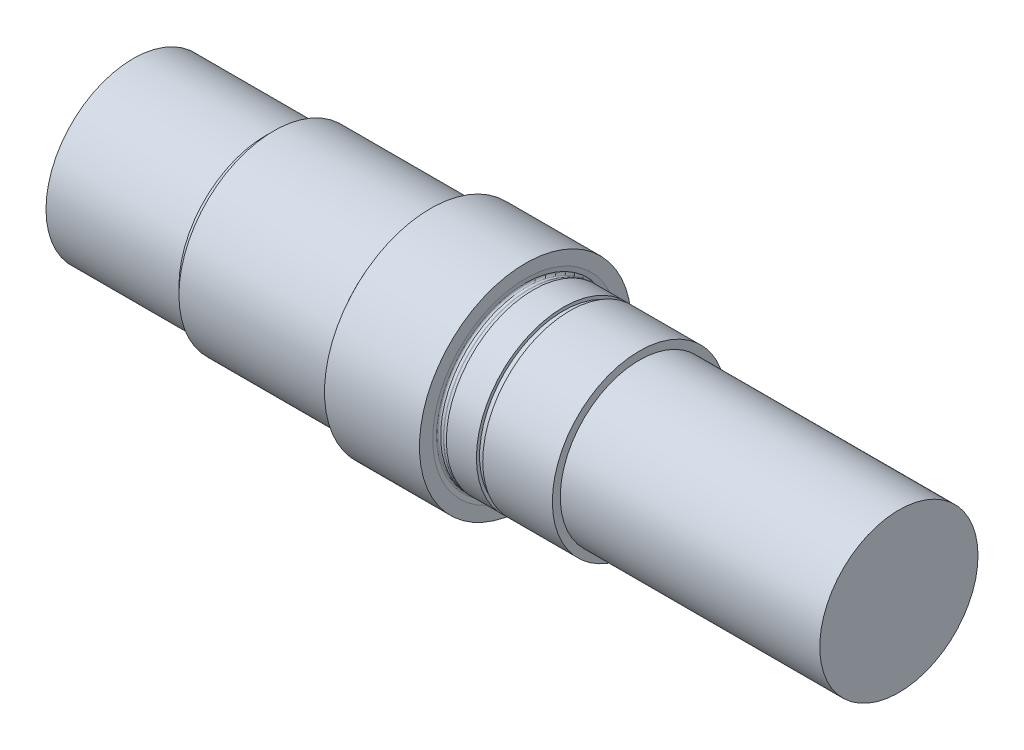
ISO-10303-21;
HEADER;
FILE_DESCRIPTION(('STEP AP214'),'2;1');
FILE_NAME('part.step','',(''),(''),'','','');
FILE_SCHEMA(('AUTOMOTIVE_DESIGN { 1 0 10303 214 1 1 1 1 }'));
ENDSEC;
DATA;
#1=APPLICATION_CONTEXT('core data for automotive mechanical design processes');
#2=APPLICATION_PROTOCOL_DEFINITION('international standard','automotive_design',2000,#1);
#3=PRODUCT_CONTEXT('',#1,'mechanical');
#4=PRODUCT('Part','Part','',(#3));
#5=PRODUCT_RELATED_PRODUCT_CATEGORY('part','',(#4));
#6=PRODUCT_DEFINITION_FORMATION('','',#4);
#7=PRODUCT_DEFINITION_CONTEXT('part definition',#1,'design');
#8=PRODUCT_DEFINITION('design','',#6,#7);
#9=PRODUCT_DEFINITION_SHAPE('','',#8);
#10=(LENGTH_UNIT() NAMED_UNIT(*) SI_UNIT(.MILLI.,.METRE.));
#11=(NAMED_UNIT(*) PLANE_ANGLE_UNIT() SI_UNIT($,.RADIAN.));
#12=(NAMED_UNIT(*) SI_UNIT($,.STERADIAN.) SOLID_ANGLE_UNIT());
#13=UNCERTAINTY_MEASURE_WITH_UNIT(LENGTH_MEASURE(1.E-05),#10,'distance_accuracy_value','');
#14=(GEOMETRIC_REPRESENTATION_CONTEXT(3) GLOBAL_UNCERTAINTY_ASSIGNED_CONTEXT((#13)) GLOBAL_UNIT_ASSIGNED_CONTEXT((#10,
#11,#12)) REPRESENTATION_CONTEXT('',''));
#15=CARTESIAN_POINT('',(0.,0.,0.));
#16=DIRECTION('',(0.,0.,1.));
#17=DIRECTION('',(1.,0.,0.));
#18=AXIS2_PLACEMENT_3D('',#15,#16,#17);
#19=CARTESIAN_POINT('',(0.,0.,0.));
#20=DIRECTION('',(-1.,0.,0.));
#21=DIRECTION('',(0.,0.,1.));
#22=AXIS2_PLACEMENT_3D('',#19,#20,#21);
#23=PLANE('',#22);
#24=CARTESIAN_POINT('',(0.,0.,0.));
#25=DIRECTION('',(1.,0.,0.));
#26=DIRECTION('',(0.,0.,-1.));
#27=AXIS2_PLACEMENT_3D('',#24,#25,#26);
#28=CIRCLE('',#27,27.5);
#29=CARTESIAN_POINT('',(0.,0.,-27.5));
#30=VERTEX_POINT('',#29);
#31=EDGE_CURVE('E10',#30,#30,#28,.T.);
#32=ORIENTED_EDGE('',*,*,#31,.F.);
#33=EDGE_LOOP('',(#32));
#34=FACE_BOUND('',#33,.T.);
#35=ADVANCED_FACE('F31',(#34),#23,.T.);
#36=CARTESIAN_POINT('',(242.,0.,0.));
#37=DIRECTION('',(1.,0.,0.));
#38=DIRECTION('',(0.,0.,-1.));
#39=AXIS2_PLACEMENT_3D('',#36,#37,#38);
#40=CYLINDRICAL_SURFACE('',#39,27.5);
#41=ORIENTED_EDGE('',*,*,#31,.T.);
#42=EDGE_LOOP('',(#41));
#43=FACE_BOUND('',#42,.T.);
#44=CARTESIAN_POINT('',(42.,0.,0.));
#45=DIRECTION('',(1.,0.,0.));
#46=DIRECTION('',(0.,0.,-1.));
#47=AXIS2_PLACEMENT_3D('',#44,#45,#46);
#48=CIRCLE('',#47,27.5);
#49=CARTESIAN_POINT('',(42.,0.,-27.5));
#50=VERTEX_POINT('',#49);
#51=EDGE_CURVE('E37',#50,#50,#48,.T.);
#52=ORIENTED_EDGE('',*,*,#51,.F.);
#53=EDGE_LOOP('',(#52));
#54=FACE_BOUND('',#53,.T.);
#55=ADVANCED_FACE('F142',(#43,#54),#40,.T.);
#56=CARTESIAN_POINT('',(43.0433153137616,0.,0.));
#57=DIRECTION('',(-1.,0.,0.));
#58=DIRECTION('',(0.,0.,1.));
#59=AXIS2_PLACEMENT_3D('',#56,#57,#58);
#60=CONICAL_SURFACE('',#59,27.2204445042266,0.261799387799148);
#61=ORIENTED_EDGE('',*,*,#51,.T.);
#62=EDGE_LOOP('',(#61));
#63=FACE_BOUND('',#62,.T.);
#64=CARTESIAN_POINT('',(43.0433153137616,0.,0.));
#65=DIRECTION('',(1.,0.,0.));
#66=DIRECTION('',(0.,0.,-1.));
#67=AXIS2_PLACEMENT_3D('',#64,#65,#66);
#68=CIRCLE('',#67,27.2204445042266);
#69=CARTESIAN_POINT('',(43.0433153137616,0.,-27.2204445042266));
#70=VERTEX_POINT('',#69);
#71=EDGE_CURVE('E41',#70,#70,#68,.T.);
#72=ORIENTED_EDGE('',*,*,#71,.F.);
#73=EDGE_LOOP('',(#72));
#74=FACE_BOUND('',#73,.T.);
#75=ADVANCED_FACE('F147',(#63,#74),#60,.T.);
#76=CARTESIAN_POINT('',(43.1986067408231,0.,0.));
#77=DIRECTION('',(1.,0.,0.));
#78=DIRECTION('',(0.,0.,-1.));
#79=AXIS2_PLACEMENT_3D('',#76,#77,#78);
#80=TOROIDAL_SURFACE('',#79,27.8,0.6);
#81=ORIENTED_EDGE('',*,*,#71,.T.);
#82=EDGE_LOOP('',(#81));
#83=FACE_BOUND('',#82,.T.);
#84=CARTESIAN_POINT('',(43.1986067408231,0.,0.));
#85=DIRECTION('',(1.,0.,0.));
#86=DIRECTION('',(0.,0.,-1.));
#87=AXIS2_PLACEMENT_3D('',#84,#85,#86);
#88=CIRCLE('',#87,27.2);
#89=CARTESIAN_POINT('',(43.1986067408231,0.,-27.2));
#90=VERTEX_POINT('',#89);
#91=EDGE_CURVE('E45',#90,#90,#88,.T.);
#92=ORIENTED_EDGE('',*,*,#91,.F.);
#93=EDGE_LOOP('',(#92));
#94=FACE_BOUND('',#93,.T.);
#95=ADVANCED_FACE('F151',(#83,#94),#80,.F.);
#96=CARTESIAN_POINT('',(242.,0.,0.));
#97=DIRECTION('',(1.,0.,0.));
#98=DIRECTION('',(0.,0.,-1.));
#99=AXIS2_PLACEMENT_3D('',#96,#97,#98);
#100=CYLINDRICAL_SURFACE('',#99,27.2);
#101=ORIENTED_EDGE('',*,*,#91,.T.);
#102=EDGE_LOOP('',(#101));
#103=FACE_BOUND('',#102,.T.);
#104=CARTESIAN_POINT('',(44.0673155509642,0.,0.));
#105=DIRECTION('',(1.,0.,0.));
#106=DIRECTION('',(0.,0.,-1.));
#107=AXIS2_PLACEMENT_3D('',#104,#105,#106);
#108=CIRCLE('',#107,27.2);
#109=CARTESIAN_POINT('',(44.0673155509642,0.,-27.2));
#110=VERTEX_POINT('',#109);
#111=EDGE_CURVE('E50',#110,#110,#108,.T.);
#112=ORIENTED_EDGE('',*,*,#111,.F.);
#113=EDGE_LOOP('',(#112));
#114=FACE_BOUND('',#113,.T.);
#115=ADVANCED_FACE('F157',(#103,#114),#100,.T.);
#116=CARTESIAN_POINT('',(44.0673155509642,0.,0.));
#117=DIRECTION('',(1.,0.,0.));
#118=DIRECTION('',(0.,0.,-1.));
#119=AXIS2_PLACEMENT_3D('',#116,#117,#118);
#120=TOROIDAL_SURFACE('',#119,27.8326844490358,0.63268444903581);
#121=ORIENTED_EDGE('',*,*,#111,.T.);
#122=EDGE_LOOP('',(#121));
#123=FACE_BOUND('',#122,.T.);
#124=CARTESIAN_POINT('',(44.6938427584337,0.,0.));
#125=DIRECTION('',(1.,0.,0.));
#126=DIRECTION('',(0.,0.,-1.));
#127=AXIS2_PLACEMENT_3D('',#124,#125,#126);
#128=CIRCLE('',#127,27.9207371057373);
#129=CARTESIAN_POINT('',(44.6938427584337,0.,-27.9207371057373));
#130=VERTEX_POINT('',#129);
#131=EDGE_CURVE('E53',#130,#130,#128,.T.);
#132=ORIENTED_EDGE('',*,*,#131,.F.);
#133=EDGE_LOOP('',(#132));
#134=FACE_BOUND('',#133,.T.);
#135=ADVANCED_FACE('F161',(#123,#134),#120,.F.);
#136=CARTESIAN_POINT('',(44.5,0.,0.));
#137=DIRECTION('',(-1.,0.,0.));
#138=DIRECTION('',(0.,0.,1.));
#139=AXIS2_PLACEMENT_3D('',#136,#137,#138);
#140=CONICAL_SURFACE('',#139,29.3,1.43116998663536);
#141=ORIENTED_EDGE('',*,*,#131,.T.);
#142=EDGE_LOOP('',(#141));
#143=FACE_BOUND('',#142,.T.);
#144=CARTESIAN_POINT('',(44.5,0.,0.));
#145=DIRECTION('',(1.,0.,0.));
#146=DIRECTION('',(0.,0.,-1.));
#147=AXIS2_PLACEMENT_3D('',#144,#145,#146);
#148=CIRCLE('',#147,29.3);
#149=CARTESIAN_POINT('',(44.5,0.,-29.3));
#150=VERTEX_POINT('',#149);
#151=EDGE_CURVE('E56',#150,#150,#148,.T.);
#152=ORIENTED_EDGE('',*,*,#151,.F.);
#153=EDGE_LOOP('',(#152));
#154=FACE_BOUND('',#153,.T.);
#155=ADVANCED_FACE('F165',(#143,#154),#140,.F.);
#156=CARTESIAN_POINT('',(44.5,0.,-30.));
#157=DIRECTION('',(-1.,0.,0.));
#158=DIRECTION('',(0.,0.,1.));
#159=AXIS2_PLACEMENT_3D('',#156,#157,#158);
#160=PLANE('',#159);
#161=ORIENTED_EDGE('',*,*,#151,.T.);
#162=EDGE_LOOP('',(#161));
#163=FACE_BOUND('',#162,.T.);
#164=CARTESIAN_POINT('',(44.5,0.,0.));
#165=DIRECTION('',(1.,0.,0.));
#166=DIRECTION('',(0.,0.,-1.));
#167=AXIS2_PLACEMENT_3D('',#164,#165,#166);
#168=CIRCLE('',#167,30.);
#169=CARTESIAN_POINT('',(44.5,0.,-30.));
#170=VERTEX_POINT('',#169);
#171=EDGE_CURVE('E59',#170,#170,#168,.T.);
#172=ORIENTED_EDGE('',*,*,#171,.F.);
#173=EDGE_LOOP('',(#172));
#174=FACE_BOUND('',#173,.T.);
#175=ADVANCED_FACE('F169',(#163,#174),#160,.T.);
#176=CARTESIAN_POINT('',(242.,0.,0.));
#177=DIRECTION('',(1.,0.,0.));
#178=DIRECTION('',(0.,0.,-1.));
#179=AXIS2_PLACEMENT_3D('',#176,#177,#178);
#180=CYLINDRICAL_SURFACE('',#179,30.);
#181=ORIENTED_EDGE('',*,*,#171,.T.);
#182=EDGE_LOOP('',(#181));
#183=FACE_BOUND('',#182,.T.);
#184=CARTESIAN_POINT('',(91.5,0.,0.));
#185=DIRECTION('',(1.,0.,0.));
#186=DIRECTION('',(0.,0.,-1.));
#187=AXIS2_PLACEMENT_3D('',#184,#185,#186);
#188=CIRCLE('',#187,30.);
#189=CARTESIAN_POINT('',(91.5,0.,-30.));
#190=VERTEX_POINT('',#189);
#191=EDGE_CURVE('E62',#190,#190,#188,.T.);
#192=ORIENTED_EDGE('',*,*,#191,.F.);
#193=EDGE_LOOP('',(#192));
#194=FACE_BOUND('',#193,.T.);
#195=ADVANCED_FACE('F173',(#183,#194),#180,.T.);
#196=CARTESIAN_POINT('',(92.5433153137616,0.,0.));
#197=DIRECTION('',(-1.,0.,0.));
#198=DIRECTION('',(0.,0.,1.));
#199=AXIS2_PLACEMENT_3D('',#196,#197,#198);
#200=CONICAL_SURFACE('',#199,29.7204445042266,0.261799387799139);
#201=ORIENTED_EDGE('',*,*,#191,.T.);
#202=EDGE_LOOP('',(#201));
#203=FACE_BOUND('',#202,.T.);
#204=CARTESIAN_POINT('',(92.5433153137616,0.,0.));
#205=DIRECTION('',(1.,0.,0.));
#206=DIRECTION('',(0.,0.,-1.));
#207=AXIS2_PLACEMENT_3D('',#204,#205,#206);
#208=CIRCLE('',#207,29.7204445042266);
#209=CARTESIAN_POINT('',(92.5433153137616,0.,-29.7204445042266));
#210=VERTEX_POINT('',#209);
#211=EDGE_CURVE('E65',#210,#210,#208,.T.);
#212=ORIENTED_EDGE('',*,*,#211,.F.);
#213=EDGE_LOOP('',(#212));
#214=FACE_BOUND('',#213,.T.);
#215=ADVANCED_FACE('F177',(#203,#214),#200,.T.);
#216=CARTESIAN_POINT('',(92.6986067408231,0.,0.));
#217=DIRECTION('',(1.,0.,0.));
#218=DIRECTION('',(0.,0.,-1.));
#219=AXIS2_PLACEMENT_3D('',#216,#217,#218);
#220=TOROIDAL_SURFACE('',#219,30.3,0.600000000000001);
#221=ORIENTED_EDGE('',*,*,#211,.T.);
#222=EDGE_LOOP('',(#221));
#223=FACE_BOUND('',#222,.T.);
#224=CARTESIAN_POINT('',(92.6986067408231,0.,0.));
#225=DIRECTION('',(1.,0.,0.));
#226=DIRECTION('',(0.,0.,-1.));
#227=AXIS2_PLACEMENT_3D('',#224,#225,#226);
#228=CIRCLE('',#227,29.7);
#229=CARTESIAN_POINT('',(92.6986067408231,0.,-29.7));
#230=VERTEX_POINT('',#229);
#231=EDGE_CURVE('E68',#230,#230,#228,.T.);
#232=ORIENTED_EDGE('',*,*,#231,.F.);
#233=EDGE_LOOP('',(#232));
#234=FACE_BOUND('',#233,.T.);
#235=ADVANCED_FACE('F181',(#223,#234),#220,.F.);
#236=CARTESIAN_POINT('',(242.,0.,0.));
#237=DIRECTION('',(1.,0.,0.));
#238=DIRECTION('',(0.,0.,-1.));
#239=AXIS2_PLACEMENT_3D('',#236,#237,#238);
#240=CYLINDRICAL_SURFACE('',#239,29.7);
#241=ORIENTED_EDGE('',*,*,#231,.T.);
#242=EDGE_LOOP('',(#241));
#243=FACE_BOUND('',#242,.T.);
#244=CARTESIAN_POINT('',(93.6,0.,0.));
#245=DIRECTION('',(1.,0.,0.));
#246=DIRECTION('',(0.,0.,-1.));
#247=AXIS2_PLACEMENT_3D('',#244,#245,#246);
#248=CIRCLE('',#247,29.7);
#249=CARTESIAN_POINT('',(93.6,0.,-29.7));
#250=VERTEX_POINT('',#249);
#251=EDGE_CURVE('E71',#250,#250,#248,.T.);
#252=ORIENTED_EDGE('',*,*,#251,.F.);
#253=EDGE_LOOP('',(#252));
#254=FACE_BOUND('',#253,.T.);
#255=ADVANCED_FACE('F185',(#243,#254),#240,.T.);
#256=CARTESIAN_POINT('',(93.6,0.,0.));
#257=DIRECTION('',(1.,0.,0.));
#258=DIRECTION('',(0.,0.,-1.));
#259=AXIS2_PLACEMENT_3D('',#256,#257,#258);
#260=TOROIDAL_SURFACE('',#259,30.3,0.599999999999999);
#261=ORIENTED_EDGE('',*,*,#251,.T.);
#262=EDGE_LOOP('',(#261));
#263=FACE_BOUND('',#262,.T.);
#264=CARTESIAN_POINT('',(94.1944414504958,0.,0.));
#265=DIRECTION('',(1.,0.,0.));
#266=DIRECTION('',(0.,0.,-1.));
#267=AXIS2_PLACEMENT_3D('',#264,#265,#266);
#268=CIRCLE('',#267,30.3814822798678);
#269=CARTESIAN_POINT('',(94.1944414504958,0.,-30.3814822798678));
#270=VERTEX_POINT('',#269);
#271=EDGE_CURVE('E74',#270,#270,#268,.T.);
#272=ORIENTED_EDGE('',*,*,#271,.F.);
#273=EDGE_LOOP('',(#272));
#274=FACE_BOUND('',#273,.T.);
#275=ADVANCED_FACE('F189',(#263,#274),#260,.F.);
#276=CARTESIAN_POINT('',(94.,0.,0.));
#277=DIRECTION('',(-1.,0.,0.));
#278=DIRECTION('',(0.,0.,1.));
#279=AXIS2_PLACEMENT_3D('',#276,#277,#278);
#280=CONICAL_SURFACE('',#279,31.8,1.43457159333425);
#281=ORIENTED_EDGE('',*,*,#271,.T.);
#282=EDGE_LOOP('',(#281));
#283=FACE_BOUND('',#282,.T.);
#284=CARTESIAN_POINT('',(94.,0.,0.));
#285=DIRECTION('',(1.,0.,0.));
#286=DIRECTION('',(0.,0.,-1.));
#287=AXIS2_PLACEMENT_3D('',#284,#285,#286);
#288=CIRCLE('',#287,31.8);
#289=CARTESIAN_POINT('',(94.,0.,-31.8));
#290=VERTEX_POINT('',#289);
#291=EDGE_CURVE('E77',#290,#290,#288,.T.);
#292=ORIENTED_EDGE('',*,*,#291,.F.);
#293=EDGE_LOOP('',(#292));
#294=FACE_BOUND('',#293,.T.);
#295=ADVANCED_FACE('F193',(#283,#294),#280,.F.);
#296=CARTESIAN_POINT('',(94.,0.,-31.8));
#297=DIRECTION('',(-1.,0.,0.));
#298=DIRECTION('',(0.,0.,1.));
#299=AXIS2_PLACEMENT_3D('',#296,#297,#298);
#300=PLANE('',#299);
#301=ORIENTED_EDGE('',*,*,#291,.T.);
#302=EDGE_LOOP('',(#301));
#303=FACE_BOUND('',#302,.T.);
#304=CARTESIAN_POINT('',(94.,0.,0.));
#305=DIRECTION('',(1.,0.,0.));
#306=DIRECTION('',(0.,0.,-1.));
#307=AXIS2_PLACEMENT_3D('',#304,#305,#306);
#308=CIRCLE('',#307,33.5);
#309=CARTESIAN_POINT('',(94.,0.,-33.5));
#310=VERTEX_POINT('',#309);
#311=EDGE_CURVE('E80',#310,#310,#308,.T.);
#312=ORIENTED_EDGE('',*,*,#311,.F.);
#313=EDGE_LOOP('',(#312));
#314=FACE_BOUND('',#313,.T.);
#315=ADVANCED_FACE('F197',(#303,#314),#300,.T.);
#316=CARTESIAN_POINT('',(242.,0.,0.));
#317=DIRECTION('',(1.,0.,0.));
#318=DIRECTION('',(0.,0.,-1.));
#319=AXIS2_PLACEMENT_3D('',#316,#317,#318);
#320=CYLINDRICAL_SURFACE('',#319,33.5);
#321=ORIENTED_EDGE('',*,*,#311,.T.);
#322=EDGE_LOOP('',(#321));
#323=FACE_BOUND('',#322,.T.);
#324=CARTESIAN_POINT('',(124.,0.,0.));
#325=DIRECTION('',(1.,0.,0.));
#326=DIRECTION('',(0.,0.,-1.));
#327=AXIS2_PLACEMENT_3D('',#324,#325,#326);
#328=CIRCLE('',#327,33.5);
#329=CARTESIAN_POINT('',(124.,0.,-33.5));
#330=VERTEX_POINT('',#329);
#331=EDGE_CURVE('E83',#330,#330,#328,.T.);
#332=ORIENTED_EDGE('',*,*,#331,.F.);
#333=EDGE_LOOP('',(#332));
#334=FACE_BOUND('',#333,.T.);
#335=ADVANCED_FACE('F201',(#323,#334),#320,.T.);
#336=CARTESIAN_POINT('',(124.,0.,-33.5));
#337=DIRECTION('',(1.,0.,0.));
#338=DIRECTION('',(0.,0.,-1.));
#339=AXIS2_PLACEMENT_3D('',#336,#337,#338);
#340=PLANE('',#339);
#341=ORIENTED_EDGE('',*,*,#331,.T.);
#342=EDGE_LOOP('',(#341));
#343=FACE_BOUND('',#342,.T.);
#344=CARTESIAN_POINT('',(124.,0.,0.));
#345=DIRECTION('',(1.,0.,0.));
#346=DIRECTION('',(0.,0.,-1.));
#347=AXIS2_PLACEMENT_3D('',#344,#345,#346);
#348=CIRCLE('',#347,29.3);
#349=CARTESIAN_POINT('',(124.,0.,-29.3));
#350=VERTEX_POINT('',#349);
#351=EDGE_CURVE('E86',#350,#350,#348,.T.);
#352=ORIENTED_EDGE('',*,*,#351,.F.);
#353=EDGE_LOOP('',(#352));
#354=FACE_BOUND('',#353,.T.);
#355=ADVANCED_FACE('F205',(#343,#354),#340,.T.);
#356=CARTESIAN_POINT('',(123.805558549504,0.,0.));
#357=DIRECTION('',(1.,0.,0.));
#358=DIRECTION('',(0.,0.,-1.));
#359=AXIS2_PLACEMENT_3D('',#356,#357,#358);
#360=CONICAL_SURFACE('',#359,27.8814822798678,1.43457159333425);
#361=ORIENTED_EDGE('',*,*,#351,.T.);
#362=EDGE_LOOP('',(#361));
#363=FACE_BOUND('',#362,.T.);
#364=CARTESIAN_POINT('',(123.805558549504,0.,0.));
#365=DIRECTION('',(1.,0.,0.));
#366=DIRECTION('',(0.,0.,-1.));
#367=AXIS2_PLACEMENT_3D('',#364,#365,#366);
#368=CIRCLE('',#367,27.8814822798678);
#369=CARTESIAN_POINT('',(123.805558549504,0.,-27.8814822798678));
#370=VERTEX_POINT('',#369);
#371=EDGE_CURVE('E89',#370,#370,#368,.T.);
#372=ORIENTED_EDGE('',*,*,#371,.F.);
#373=EDGE_LOOP('',(#372));
#374=FACE_BOUND('',#373,.T.);
#375=ADVANCED_FACE('F209',(#363,#374),#360,.F.);
#376=CARTESIAN_POINT('',(124.4,0.,0.));
#377=DIRECTION('',(1.,0.,0.));
#378=DIRECTION('',(0.,0.,-1.));
#379=AXIS2_PLACEMENT_3D('',#376,#377,#378);
#380=TOROIDAL_SURFACE('',#379,27.8,0.599999999999999);
#381=ORIENTED_EDGE('',*,*,#371,.T.);
#382=EDGE_LOOP('',(#381));
#383=FACE_BOUND('',#382,.T.);
#384=CARTESIAN_POINT('',(124.4,0.,0.));
#385=DIRECTION('',(1.,0.,0.));
#386=DIRECTION('',(0.,0.,-1.));
#387=AXIS2_PLACEMENT_3D('',#384,#385,#386);
#388=CIRCLE('',#387,27.2);
#389=CARTESIAN_POINT('',(124.4,0.,-27.2));
#390=VERTEX_POINT('',#389);
#391=EDGE_CURVE('E92',#390,#390,#388,.T.);
#392=ORIENTED_EDGE('',*,*,#391,.F.);
#393=EDGE_LOOP('',(#392));
#394=FACE_BOUND('',#393,.T.);
#395=ADVANCED_FACE('F213',(#383,#394),#380,.F.);
#396=CARTESIAN_POINT('',(242.,0.,0.));
#397=DIRECTION('',(1.,0.,0.));
#398=DIRECTION('',(0.,0.,-1.));
#399=AXIS2_PLACEMENT_3D('',#396,#397,#398);
#400=CYLINDRICAL_SURFACE('',#399,27.2);
#401=ORIENTED_EDGE('',*,*,#391,.T.);
#402=EDGE_LOOP('',(#401));
#403=FACE_BOUND('',#402,.T.);
#404=CARTESIAN_POINT('',(125.301393259177,0.,0.));
#405=DIRECTION('',(1.,0.,0.));
#406=DIRECTION('',(0.,0.,-1.));
#407=AXIS2_PLACEMENT_3D('',#404,#405,#406);
#408=CIRCLE('',#407,27.2);
#409=CARTESIAN_POINT('',(125.301393259177,0.,-27.2));
#410=VERTEX_POINT('',#409);
#411=EDGE_CURVE('E95',#410,#410,#408,.T.);
#412=ORIENTED_EDGE('',*,*,#411,.F.);
#413=EDGE_LOOP('',(#412));
#414=FACE_BOUND('',#413,.T.);
#415=ADVANCED_FACE('F217',(#403,#414),#400,.T.);
#416=CARTESIAN_POINT('',(125.301393259177,0.,0.));
#417=DIRECTION('',(1.,0.,0.));
#418=DIRECTION('',(0.,0.,-1.));
#419=AXIS2_PLACEMENT_3D('',#416,#417,#418);
#420=TOROIDAL_SURFACE('',#419,27.8,0.599999999999995);
#421=ORIENTED_EDGE('',*,*,#411,.T.);
#422=EDGE_LOOP('',(#421));
#423=FACE_BOUND('',#422,.T.);
#424=CARTESIAN_POINT('',(125.456684686238,0.,0.));
#425=DIRECTION('',(1.,0.,0.));
#426=DIRECTION('',(0.,0.,-1.));
#427=AXIS2_PLACEMENT_3D('',#424,#425,#426);
#428=CIRCLE('',#427,27.2204445042266);
#429=CARTESIAN_POINT('',(125.456684686238,0.,-27.2204445042266));
#430=VERTEX_POINT('',#429);
#431=EDGE_CURVE('E98',#430,#430,#428,.T.);
#432=ORIENTED_EDGE('',*,*,#431,.F.);
#433=EDGE_LOOP('',(#432));
#434=FACE_BOUND('',#433,.T.);
#435=ADVANCED_FACE('F221',(#423,#434),#420,.F.);
#436=CARTESIAN_POINT('',(126.5,0.,0.));
#437=DIRECTION('',(1.,0.,0.));
#438=DIRECTION('',(0.,0.,-1.));
#439=AXIS2_PLACEMENT_3D('',#436,#437,#438);
#440=CONICAL_SURFACE('',#439,27.5,0.261799387799142);
#441=ORIENTED_EDGE('',*,*,#431,.T.);
#442=EDGE_LOOP('',(#441));
#443=FACE_BOUND('',#442,.T.);
#444=CARTESIAN_POINT('',(126.5,0.,0.));
#445=DIRECTION('',(1.,0.,0.));
#446=DIRECTION('',(0.,0.,-1.));
#447=AXIS2_PLACEMENT_3D('',#444,#445,#446);
#448=CIRCLE('',#447,27.5);
#449=CARTESIAN_POINT('',(126.5,0.,-27.5));
#450=VERTEX_POINT('',#449);
#451=EDGE_CURVE('E101',#450,#450,#448,.T.);
#452=ORIENTED_EDGE('',*,*,#451,.F.);
#453=EDGE_LOOP('',(#452));
#454=FACE_BOUND('',#453,.T.);
#455=ADVANCED_FACE('F225',(#443,#454),#440,.T.);
#456=CARTESIAN_POINT('',(242.,0.,0.));
#457=DIRECTION('',(1.,0.,0.));
#458=DIRECTION('',(0.,0.,-1.));
#459=AXIS2_PLACEMENT_3D('',#456,#457,#458);
#460=CYLINDRICAL_SURFACE('',#459,27.5);
#461=ORIENTED_EDGE('',*,*,#451,.T.);
#462=EDGE_LOOP('',(#461));
#463=FACE_BOUND('',#462,.T.);
#464=CARTESIAN_POINT('',(136.,0.,0.));
#465=DIRECTION('',(1.,0.,0.));
#466=DIRECTION('',(0.,0.,-1.));
#467=AXIS2_PLACEMENT_3D('',#464,#465,#466);
#468=CIRCLE('',#467,27.5);
#469=CARTESIAN_POINT('',(136.,0.,-27.5));
#470=VERTEX_POINT('',#469);
#471=EDGE_CURVE('E104',#470,#470,#468,.T.);
#472=ORIENTED_EDGE('',*,*,#471,.F.);
#473=EDGE_LOOP('',(#472));
#474=FACE_BOUND('',#473,.T.);
#475=ADVANCED_FACE('F229',(#463,#474),#460,.T.);
#476=CARTESIAN_POINT('',(136.,0.,-27.5));
#477=DIRECTION('',(1.,0.,0.));
#478=DIRECTION('',(0.,0.,-1.));
#479=AXIS2_PLACEMENT_3D('',#476,#477,#478);
#480=PLANE('',#479);
#481=ORIENTED_EDGE('',*,*,#471,.T.);
#482=EDGE_LOOP('',(#481));
#483=FACE_BOUND('',#482,.T.);
#484=CARTESIAN_POINT('',(136.,0.,0.));
#485=DIRECTION('',(1.,0.,0.));
#486=DIRECTION('',(0.,0.,-1.));
#487=AXIS2_PLACEMENT_3D('',#484,#485,#486);
#488=CIRCLE('',#487,26.5);
#489=CARTESIAN_POINT('',(136.,0.,-26.5));
#490=VERTEX_POINT('',#489);
#491=EDGE_CURVE('E107',#490,#490,#488,.T.);
#492=ORIENTED_EDGE('',*,*,#491,.F.);
#493=EDGE_LOOP('',(#492));
#494=FACE_BOUND('',#493,.T.);
#495=ADVANCED_FACE('F233',(#483,#494),#480,.T.);
#496=CARTESIAN_POINT('',(242.,0.,0.));
#497=DIRECTION('',(1.,0.,0.));
#498=DIRECTION('',(0.,0.,-1.));
#499=AXIS2_PLACEMENT_3D('',#496,#497,#498);
#500=CYLINDRICAL_SURFACE('',#499,26.5);
#501=ORIENTED_EDGE('',*,*,#491,.T.);
#502=EDGE_LOOP('',(#501));
#503=FACE_BOUND('',#502,.T.);
#504=CARTESIAN_POINT('',(138.,0.,0.));
#505=DIRECTION('',(1.,0.,0.));
#506=DIRECTION('',(0.,0.,-1.));
#507=AXIS2_PLACEMENT_3D('',#504,#505,#506);
#508=CIRCLE('',#507,26.5);
#509=CARTESIAN_POINT('',(138.,0.,-26.5));
#510=VERTEX_POINT('',#509);
#511=EDGE_CURVE('E110',#510,#510,#508,.T.);
#512=ORIENTED_EDGE('',*,*,#511,.F.);
#513=EDGE_LOOP('',(#512));
#514=FACE_BOUND('',#513,.T.);
#515=ADVANCED_FACE('F237',(#503,#514),#500,.T.);
#516=CARTESIAN_POINT('',(138.,0.,-26.5));
#517=DIRECTION('',(-1.,0.,0.));
#518=DIRECTION('',(0.,0.,1.));
#519=AXIS2_PLACEMENT_3D('',#516,#517,#518);
#520=PLANE('',#519);
#521=ORIENTED_EDGE('',*,*,#511,.T.);
#522=EDGE_LOOP('',(#521));
#523=FACE_BOUND('',#522,.T.);
#524=CARTESIAN_POINT('',(138.,0.,0.));
#525=DIRECTION('',(1.,0.,0.));
#526=DIRECTION('',(0.,0.,-1.));
#527=AXIS2_PLACEMENT_3D('',#524,#525,#526);
#528=CIRCLE('',#527,27.5);
#529=CARTESIAN_POINT('',(138.,0.,-27.5));
#530=VERTEX_POINT('',#529);
#531=EDGE_CURVE('E113',#530,#530,#528,.T.);
#532=ORIENTED_EDGE('',*,*,#531,.F.);
#533=EDGE_LOOP('',(#532));
#534=FACE_BOUND('',#533,.T.);
#535=ADVANCED_FACE('F241',(#523,#534),#520,.T.);
#536=CARTESIAN_POINT('',(242.,0.,0.));
#537=DIRECTION('',(1.,0.,0.));
#538=DIRECTION('',(0.,0.,-1.));
#539=AXIS2_PLACEMENT_3D('',#536,#537,#538);
#540=CYLINDRICAL_SURFACE('',#539,27.5);
#541=ORIENTED_EDGE('',*,*,#531,.T.);
#542=EDGE_LOOP('',(#541));
#543=FACE_BOUND('',#542,.T.);
#544=CARTESIAN_POINT('',(160.,0.,0.));
#545=DIRECTION('',(1.,0.,0.));
#546=DIRECTION('',(0.,0.,-1.));
#547=AXIS2_PLACEMENT_3D('',#544,#545,#546);
#548=CIRCLE('',#547,27.5);
#549=CARTESIAN_POINT('',(160.,0.,-27.5));
#550=VERTEX_POINT('',#549);
#551=EDGE_CURVE('E116',#550,#550,#548,.T.);
#552=ORIENTED_EDGE('',*,*,#551,.F.);
#553=EDGE_LOOP('',(#552));
#554=FACE_BOUND('',#553,.T.);
#555=ADVANCED_FACE('F138',(#543,#554),#540,.T.);
#556=CARTESIAN_POINT('',(160.,0.,-27.5));
#557=DIRECTION('',(1.,0.,0.));
#558=DIRECTION('',(0.,0.,-1.));
#559=AXIS2_PLACEMENT_3D('',#556,#557,#558);
#560=PLANE('',#559);
#561=ORIENTED_EDGE('',*,*,#551,.T.);
#562=EDGE_LOOP('',(#561));
#563=FACE_BOUND('',#562,.T.);
#564=CARTESIAN_POINT('',(160.,0.,0.));
#565=DIRECTION('',(1.,0.,0.));
#566=DIRECTION('',(0.,0.,-1.));
#567=AXIS2_PLACEMENT_3D('',#564,#565,#566);
#568=CIRCLE('',#567,25.);
#569=CARTESIAN_POINT('',(160.,0.,-25.));
#570=VERTEX_POINT('',#569);
#571=EDGE_CURVE('E119',#570,#570,#568,.T.);
#572=ORIENTED_EDGE('',*,*,#571,.F.);
#573=EDGE_LOOP('',(#572));
#574=FACE_BOUND('',#573,.T.);
#575=ADVANCED_FACE('F130',(#563,#574),#560,.T.);
#576=CARTESIAN_POINT('',(242.,0.,0.));
#577=DIRECTION('',(1.,0.,0.));
#578=DIRECTION('',(0.,0.,-1.));
#579=AXIS2_PLACEMENT_3D('',#576,#577,#578);
#580=CYLINDRICAL_SURFACE('',#579,25.);
#581=ORIENTED_EDGE('',*,*,#571,.T.);
#582=EDGE_LOOP('',(#581));
#583=FACE_BOUND('',#582,.T.);
#584=CARTESIAN_POINT('',(242.,0.,0.));
#585=DIRECTION('',(1.,0.,0.));
#586=DIRECTION('',(0.,0.,-1.));
#587=AXIS2_PLACEMENT_3D('',#584,#585,#586);
#588=CIRCLE('',#587,25.);
#589=CARTESIAN_POINT('',(242.,0.,-25.));
#590=VERTEX_POINT('',#589);
#591=EDGE_CURVE('E122',#590,#590,#588,.T.);
#592=ORIENTED_EDGE('',*,*,#591,.F.);
#593=EDGE_LOOP('',(#592));
#594=FACE_BOUND('',#593,.T.);
#595=ADVANCED_FACE('F128',(#583,#594),#580,.T.);
#596=CARTESIAN_POINT('',(242.,0.,-25.));
#597=DIRECTION('',(1.,0.,0.));
#598=DIRECTION('',(0.,0.,-1.));
#599=AXIS2_PLACEMENT_3D('',#596,#597,#598);
#600=PLANE('',#599);
#601=ORIENTED_EDGE('',*,*,#591,.T.);
#602=EDGE_LOOP('',(#601));
#603=FACE_BOUND('',#602,.T.);
#604=ADVANCED_FACE('F126',(#603),#600,.T.);
#605=CLOSED_SHELL('',(#35,#55,#75,#95,#115,#135,#155,#175,#195,#215,#235,#255,#275,#295,#315,
#335,#355,#375,#395,#415,#435,#455,#475,#495,#515,#535,#555,#575,#595,#604));
#606=MANIFOLD_SOLID_BREP('B2',#605);
#607=ADVANCED_BREP_SHAPE_REPRESENTATION('',(#18,#606),#14);
#608=SHAPE_DEFINITION_REPRESENTATION(#9,#607);
ENDSEC;
END-ISO-10303-21;
